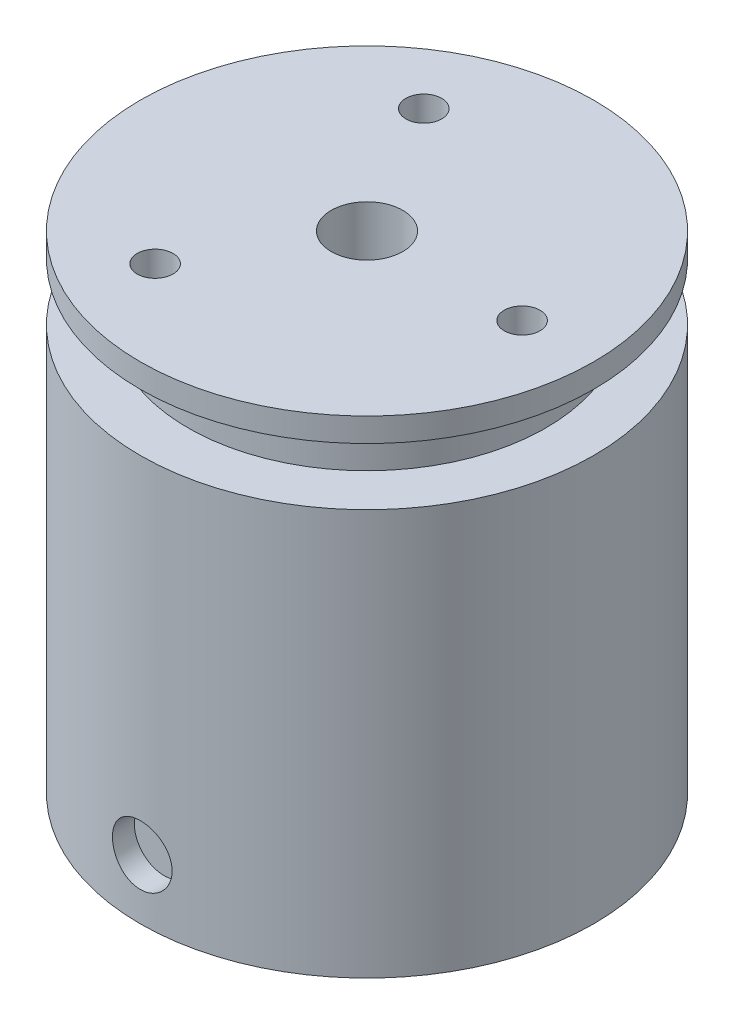
ISO-10303-21;
HEADER;
FILE_DESCRIPTION(('STEP AP214'),'2;1');
FILE_NAME('part.step','',(''),(''),'','','');
FILE_SCHEMA(('AUTOMOTIVE_DESIGN { 1 0 10303 214 1 1 1 1 }'));
ENDSEC;
DATA;
#1=APPLICATION_CONTEXT('core data for automotive mechanical design processes');
#2=APPLICATION_PROTOCOL_DEFINITION('international standard','automotive_design',2000,#1);
#3=PRODUCT_CONTEXT('',#1,'mechanical');
#4=PRODUCT('Part','Part','',(#3));
#5=PRODUCT_RELATED_PRODUCT_CATEGORY('part','',(#4));
#6=PRODUCT_DEFINITION_FORMATION('','',#4);
#7=PRODUCT_DEFINITION_CONTEXT('part definition',#1,'design');
#8=PRODUCT_DEFINITION('design','',#6,#7);
#9=PRODUCT_DEFINITION_SHAPE('','',#8);
#10=(LENGTH_UNIT() NAMED_UNIT(*) SI_UNIT(.MILLI.,.METRE.));
#11=(NAMED_UNIT(*) PLANE_ANGLE_UNIT() SI_UNIT($,.RADIAN.));
#12=(NAMED_UNIT(*) SI_UNIT($,.STERADIAN.) SOLID_ANGLE_UNIT());
#13=UNCERTAINTY_MEASURE_WITH_UNIT(LENGTH_MEASURE(1.E-05),#10,'distance_accuracy_value','');
#14=(GEOMETRIC_REPRESENTATION_CONTEXT(3) GLOBAL_UNCERTAINTY_ASSIGNED_CONTEXT((#13)) GLOBAL_UNIT_ASSIGNED_CONTEXT((#10,
#11,#12)) REPRESENTATION_CONTEXT('',''));
#15=CARTESIAN_POINT('',(0.,0.,0.));
#16=DIRECTION('',(0.,0.,1.));
#17=DIRECTION('',(1.,0.,0.));
#18=AXIS2_PLACEMENT_3D('',#15,#16,#17);
#19=CARTESIAN_POINT('',(-2.53,2.47,17.));
#20=DIRECTION('',(0.,0.,1.));
#21=DIRECTION('',(1.,0.,0.));
#22=AXIS2_PLACEMENT_3D('',#19,#20,#21);
#23=PLANE('',#22);
#24=CARTESIAN_POINT('',(0.,5.,17.));
#25=DIRECTION('',(0.,0.,-1.));
#26=DIRECTION('',(-1.,0.,0.));
#27=AXIS2_PLACEMENT_3D('',#24,#25,#26);
#28=CIRCLE('',#27,2.5);
#29=CARTESIAN_POINT('',(-2.5,5.,17.));
#30=VERTEX_POINT('',#29);
#31=EDGE_CURVE('E19',#30,#30,#28,.T.);
#32=ORIENTED_EDGE('',*,*,#31,.F.);
#33=EDGE_LOOP('',(#32));
#34=FACE_BOUND('',#33,.T.);
#35=ADVANCED_FACE('F15',(#34),#23,.T.);
#36=CARTESIAN_POINT('',(-19.228,0.,-19.228));
#37=DIRECTION('',(0.,1.,0.));
#38=DIRECTION('',(0.,0.,1.));
#39=AXIS2_PLACEMENT_3D('',#36,#37,#38);
#40=PLANE('',#39);
#41=CARTESIAN_POINT('',(0.,0.,0.));
#42=DIRECTION('',(0.,-1.,0.));
#43=DIRECTION('',(0.,0.,-1.));
#44=AXIS2_PLACEMENT_3D('',#41,#42,#43);
#45=CIRCLE('',#44,19.);
#46=CARTESIAN_POINT('',(0.,0.,-19.));
#47=VERTEX_POINT('',#46);
#48=EDGE_CURVE('E69',#47,#47,#45,.T.);
#49=ORIENTED_EDGE('',*,*,#48,.T.);
#50=EDGE_LOOP('',(#49));
#51=FACE_BOUND('',#50,.T.);
#52=ADVANCED_FACE('F77',(#51),#40,.F.);
#53=CARTESIAN_POINT('',(0.,5.,19.012));
#54=DIRECTION('',(0.,0.,-1.));
#55=DIRECTION('',(-1.,0.,0.));
#56=AXIS2_PLACEMENT_3D('',#53,#54,#55);
#57=CYLINDRICAL_SURFACE('',#56,2.5);
#58=CARTESIAN_POINT('',(-7.79392660219532E-09,2.5,19.));
#59=CARTESIAN_POINT('',(0.139773409392555,2.5000060204504,18.9999979277637));
#60=CARTESIAN_POINT('',(0.279636082187468,2.51176185948341,18.9984413236045));
#61=CARTESIAN_POINT('',(0.555469342091036,2.55847151360698,18.9923812398033));
#62=CARTESIAN_POINT('',(0.691435609073626,2.59345011200258,18.9878746119713));
#63=CARTESIAN_POINT('',(0.955439265130195,2.68555389483406,18.9764218144305));
#64=CARTESIAN_POINT('',(1.08348208052161,2.74266372376853,18.96947733651));
#65=CARTESIAN_POINT('',(1.32813772879356,2.87737167655391,18.9539203209782));
#66=CARTESIAN_POINT('',(1.44475290274007,2.95496559195393,18.9453081260958));
#67=CARTESIAN_POINT('',(1.66397097375114,3.12893476538717,18.9273183528514));
#68=CARTESIAN_POINT('',(1.76649577885706,3.22540803378587,18.9179369355255));
#69=CARTESIAN_POINT('',(1.95397273230088,3.43421563147291,18.8994944166227));
#70=CARTESIAN_POINT('',(2.03892009793698,3.54655426366593,18.89043340278));
#71=CARTESIAN_POINT('',(2.18913182772488,3.78444268043728,18.8736179843208));
#72=CARTESIAN_POINT('',(2.2543124912531,3.91004568956786,18.8658691956794));
#73=CARTESIAN_POINT('',(2.36255778994847,4.17044685287685,18.8526210808482));
#74=CARTESIAN_POINT('',(2.40564711126428,4.30523455181653,18.847119245188));
#75=CARTESIAN_POINT('',(2.45796752429332,4.53396111521166,18.8403506985919));
#76=CARTESIAN_POINT('',(2.47370721362991,4.62643997145124,18.83828246754));
#77=CARTESIAN_POINT('',(2.49472542952821,4.81259918285274,18.8355105071207));
#78=CARTESIAN_POINT('',(2.50000404101751,4.90627952825423,18.8348067666758));
#79=CARTESIAN_POINT('',(2.49999397301701,5.13976752832974,18.8348103416708));
#80=CARTESIAN_POINT('',(2.48823909231892,5.27962431484546,18.836380823103));
#81=CARTESIAN_POINT('',(2.44153359351058,5.55544534192569,18.8424904606705));
#82=CARTESIAN_POINT('',(2.40655817198268,5.69140525780772,18.8470327911615));
#83=CARTESIAN_POINT('',(2.31446368165708,5.9553954819417,18.8585629828817));
#84=CARTESIAN_POINT('',(2.25736011852096,6.08343127010354,18.8655491313426));
#85=CARTESIAN_POINT('',(2.12266692582656,6.32807512422551,18.8811773903824));
#86=CARTESIAN_POINT('',(2.04508148960602,6.44468552265953,18.8898191618996));
#87=CARTESIAN_POINT('',(1.87112091274146,6.66390890511079,18.9078442412996));
#88=CARTESIAN_POINT('',(1.77464586474557,6.76644230299737,18.9172313269442));
#89=CARTESIAN_POINT('',(1.56583109022531,6.95393586507857,18.9356577794715));
#90=CARTESIAN_POINT('',(1.45348708346821,7.03889127278613,18.9446970517011));
#91=CARTESIAN_POINT('',(1.215593895158,7.18911146078125,18.9614502977649));
#92=CARTESIAN_POINT('',(1.08999241463198,7.25429400461762,18.9691586806554));
#93=CARTESIAN_POINT('',(0.829594558290329,7.36254321649766,18.9823259545178));
#94=CARTESIAN_POINT('',(0.694808625035482,7.40563454177621,18.9877873521238));
#95=CARTESIAN_POINT('',(0.466076711301946,7.45796066430534,18.9945035751173));
#96=CARTESIAN_POINT('',(0.373590272854385,7.47370293843485,18.9965548575456));
#97=CARTESIAN_POINT('',(0.187415925748185,7.49472458394411,18.9993037594859));
#98=CARTESIAN_POINT('',(0.0937280265576765,7.50000403772535,19.000001389659));
#99=CARTESIAN_POINT('',(-0.139773424995147,7.49999397867805,18.999997927649));
#100=CARTESIAN_POINT('',(-0.279636097731497,7.4882381387704,18.9984413233747));
#101=CARTESIAN_POINT('',(-0.55546935737123,7.44152848291757,18.9923812393555));
#102=CARTESIAN_POINT('',(-0.691435624148335,7.40654988366705,18.9878746114205));
#103=CARTESIAN_POINT('',(-0.955439279651721,7.31444609917194,18.9764218136975));
#104=CARTESIAN_POINT('',(-1.08348209469562,7.25733626942894,18.9694773356977));
#105=CARTESIAN_POINT('',(-1.32813774214314,7.12262831509405,18.9539203200402));
#106=CARTESIAN_POINT('',(-1.44475291561275,7.04503439895298,18.9453081251112));
#107=CARTESIAN_POINT('',(-1.66397098555335,6.87106522411821,18.9273183518106));
#108=CARTESIAN_POINT('',(-1.76649579006465,6.77459195505899,18.9179369344753));
#109=CARTESIAN_POINT('',(-1.95397274221704,6.56578435615487,18.8994944155947));
#110=CARTESIAN_POINT('',(-2.03892010715629,6.45344572340532,18.8904334017836));
#111=CARTESIAN_POINT('',(-2.18913183544506,6.21555730565706,18.8736179834207));
#112=CARTESIAN_POINT('',(-2.25431249817324,6.08995429610826,18.8658691948438));
#113=CARTESIAN_POINT('',(-2.3625577952265,5.82955313210752,18.8526210801907));
#114=CARTESIAN_POINT('',(-2.40564711570206,5.69476543289491,18.8471192446436));
#115=CARTESIAN_POINT('',(-2.45796752593738,5.46603887486305,18.8403506983597));
#116=CARTESIAN_POINT('',(-2.47370721399312,5.37356002435567,18.8382824674427));
#117=CARTESIAN_POINT('',(-2.4947254288001,5.18740082457235,18.8355105072661));
#118=CARTESIAN_POINT('',(-2.50000404047948,5.0937204850569,18.8348067669289));
#119=CARTESIAN_POINT('',(-2.49999397433957,4.86023249084673,18.8348103417495));
#120=CARTESIAN_POINT('',(-2.48823909453172,4.72037570424856,18.8363808228775));
#121=CARTESIAN_POINT('',(-2.44153359770267,4.44455467679156,18.8424904600579));
#122=CARTESIAN_POINT('',(-2.40655817725921,4.30859476061585,18.8470327904671));
#123=CARTESIAN_POINT('',(-2.31446368898315,4.04460453576372,18.8585629819981));
#124=CARTESIAN_POINT('',(-2.25736012681819,3.91656874717541,18.8655491303512));
#125=CARTESIAN_POINT('',(-2.12266693600496,3.67192489205288,18.88117738923));
#126=CARTESIAN_POINT('',(-2.04508150069615,3.55531449304387,18.8898191606937));
#127=CARTESIAN_POINT('',(-1.87112092555102,3.3360911092946,18.9078442400292));
#128=CARTESIAN_POINT('',(-1.77464587836211,3.2335577106843,18.917231325663));
#129=CARTESIAN_POINT('',(-1.56583110532721,3.04606414702566,18.9356577782183));
#130=CARTESIAN_POINT('',(-1.45348709924801,2.96110873846486,18.9446970504866));
#131=CARTESIAN_POINT('',(-1.21559391212397,2.81088854863972,18.9614502966737));
#132=CARTESIAN_POINT('',(-1.08999243210311,2.74570600383006,18.9691586796487));
#133=CARTESIAN_POINT('',(-0.829594576600506,2.6374567899318,18.9823259537147));
#134=CARTESIAN_POINT('',(-0.694808643679673,2.59436546360852,18.9877873514399));
#135=CARTESIAN_POINT('',(-0.466076729735803,2.54203933916609,18.9945035746671));
#136=CARTESIAN_POINT('',(-0.373590290780151,2.5262970642485,18.9965548571957));
#137=CARTESIAN_POINT('',(-0.18741594256709,2.50527541729572,18.9993037593228));
#138=CARTESIAN_POINT('',(-0.0937280427778114,2.49999596285905,19.0000013895821));
#139=CARTESIAN_POINT('',(-7.79392660219532E-09,2.5,19.));
#140=B_SPLINE_CURVE_WITH_KNOTS('',3,(#58,#59,#60,#61,#62,#63,#64,#65,#66,#67,#68,#69,#70,#71,
#72,#73,#74,#75,#76,#77,#78,#79,#80,#81,#82,#83,#84,#85,#86,#87,#88,#89,#90,#91,#92,#93,#94,#95,
#96,#97,#98,#99,#100,#101,#102,#103,#104,#105,#106,#107,#108,#109,#110,#111,#112,#113,#114,#115,
#116,#117,#118,#119,#120,#121,#122,#123,#124,#125,#126,#127,#128,#129,#130,#131,#132,#133,#134,
#135,#136,#137,#138,#139),.UNSPECIFIED.,.T.,.F.,(4,2,2,2,2,2,2,2,2,2,2,2,2,2,2,2,2,2,2,2,2,2,2,
2,2,2,2,2,2,2,2,2,2,2,2,2,2,2,2,2,4),(0.,0.418977449349682,0.838402751289426,1.25753755932456,
1.67658632313426,2.09787118820846,2.51927053173498,2.94243011449595,3.36511579782529,
3.64604964814875,3.92698121771937,4.34594093444101,4.7653488917125,5.18446349075289,
5.60349234920208,6.02480043024977,6.44622236579401,6.86937371832254,7.29205173419249,
7.57300817666715,7.85396240641896,8.27293985581508,8.69236515780693,9.11149996588963,
9.53054872974783,9.95183359488269,10.3732329384697,10.7963925212364,11.2190782045378,
11.500012037383,11.7809435894603,12.1999033061593,12.619311263495,13.0384258624869,
13.4574547208532,13.8787628018204,14.3001847372962,14.7233360898384,15.1460141057243,
15.4269705500924,15.707924781738),.UNSPECIFIED.);
#141=CARTESIAN_POINT('',(-7.79392660219532E-09,2.5,19.));
#142=VERTEX_POINT('',#141);
#143=EDGE_CURVE('E63',#142,#142,#140,.T.);
#144=ORIENTED_EDGE('',*,*,#143,.T.);
#145=EDGE_LOOP('',(#144));
#146=FACE_BOUND('',#145,.T.);
#147=ORIENTED_EDGE('',*,*,#31,.T.);
#148=EDGE_LOOP('',(#147));
#149=FACE_BOUND('',#148,.T.);
#150=ADVANCED_FACE('F73',(#146,#149),#57,.F.);
#151=CARTESIAN_POINT('',(0.,34.,0.));
#152=DIRECTION('',(0.,-1.,0.));
#153=DIRECTION('',(0.,0.,-1.));
#154=AXIS2_PLACEMENT_3D('',#151,#152,#153);
#155=CYLINDRICAL_SURFACE('',#154,19.);
#156=ORIENTED_EDGE('',*,*,#48,.F.);
#157=EDGE_LOOP('',(#156));
#158=FACE_BOUND('',#157,.T.);
#159=ORIENTED_EDGE('',*,*,#143,.F.);
#160=EDGE_LOOP('',(#159));
#161=FACE_BOUND('',#160,.T.);
#162=CARTESIAN_POINT('',(0.,34.,0.));
#163=DIRECTION('',(0.,-1.,0.));
#164=DIRECTION('',(0.,0.,-1.));
#165=AXIS2_PLACEMENT_3D('',#162,#163,#164);
#166=CIRCLE('',#165,19.);
#167=CARTESIAN_POINT('',(0.,34.,-19.));
#168=VERTEX_POINT('',#167);
#169=EDGE_CURVE('E60',#168,#168,#166,.F.);
#170=ORIENTED_EDGE('',*,*,#169,.F.);
#171=EDGE_LOOP('',(#170));
#172=FACE_BOUND('',#171,.T.);
#173=ADVANCED_FACE('F70',(#158,#161,#172),#155,.T.);
#174=CARTESIAN_POINT('',(-19.228,34.,-19.228));
#175=DIRECTION('',(0.,1.,0.));
#176=DIRECTION('',(0.,0.,1.));
#177=AXIS2_PLACEMENT_3D('',#174,#175,#176);
#178=PLANE('',#177);
#179=CARTESIAN_POINT('',(0.,34.,0.));
#180=DIRECTION('',(0.,-1.,0.));
#181=DIRECTION('',(0.,0.,-1.));
#182=AXIS2_PLACEMENT_3D('',#179,#180,#181);
#183=CIRCLE('',#182,15.);
#184=CARTESIAN_POINT('',(0.,34.,-15.));
#185=VERTEX_POINT('',#184);
#186=EDGE_CURVE('E57',#185,#185,#183,.T.);
#187=ORIENTED_EDGE('',*,*,#186,.T.);
#188=EDGE_LOOP('',(#187));
#189=FACE_BOUND('',#188,.T.);
#190=ORIENTED_EDGE('',*,*,#169,.T.);
#191=EDGE_LOOP('',(#190));
#192=FACE_BOUND('',#191,.T.);
#193=ADVANCED_FACE('F85',(#189,#192),#178,.T.);
#194=CARTESIAN_POINT('',(0.,38.8,0.));
#195=DIRECTION('',(0.,-1.,0.));
#196=DIRECTION('',(0.,0.,-1.));
#197=AXIS2_PLACEMENT_3D('',#194,#195,#196);
#198=CYLINDRICAL_SURFACE('',#197,15.);
#199=CARTESIAN_POINT('',(0.,38.8,0.));
#200=DIRECTION('',(0.,-1.,0.));
#201=DIRECTION('',(0.,0.,-1.));
#202=AXIS2_PLACEMENT_3D('',#199,#200,#201);
#203=CIRCLE('',#202,15.);
#204=CARTESIAN_POINT('',(0.,38.8,-15.));
#205=VERTEX_POINT('',#204);
#206=EDGE_CURVE('E54',#205,#205,#203,.T.);
#207=ORIENTED_EDGE('',*,*,#206,.T.);
#208=EDGE_LOOP('',(#207));
#209=FACE_BOUND('',#208,.T.);
#210=ORIENTED_EDGE('',*,*,#186,.F.);
#211=EDGE_LOOP('',(#210));
#212=FACE_BOUND('',#211,.T.);
#213=ADVANCED_FACE('F88',(#209,#212),#198,.T.);
#214=CARTESIAN_POINT('',(-19.228,38.8,-19.228));
#215=DIRECTION('',(0.,1.,0.));
#216=DIRECTION('',(0.,0.,1.));
#217=AXIS2_PLACEMENT_3D('',#214,#215,#216);
#218=PLANE('',#217);
#219=ORIENTED_EDGE('',*,*,#206,.F.);
#220=EDGE_LOOP('',(#219));
#221=FACE_BOUND('',#220,.T.);
#222=CARTESIAN_POINT('',(0.,38.8,0.));
#223=DIRECTION('',(0.,-1.,0.));
#224=DIRECTION('',(1.,0.,0.));
#225=AXIS2_PLACEMENT_3D('',#222,#223,#224);
#226=CIRCLE('',#225,19.);
#227=CARTESIAN_POINT('',(19.,38.8,0.));
#228=VERTEX_POINT('',#227);
#229=EDGE_CURVE('E51',#228,#228,#226,.T.);
#230=ORIENTED_EDGE('',*,*,#229,.T.);
#231=EDGE_LOOP('',(#230));
#232=FACE_BOUND('',#231,.T.);
#233=ADVANCED_FACE('F90',(#221,#232),#218,.F.);
#234=CARTESIAN_POINT('',(11.482,33.8,-1.518));
#235=DIRECTION('',(0.,1.,0.));
#236=DIRECTION('',(0.,0.,1.));
#237=AXIS2_PLACEMENT_3D('',#234,#235,#236);
#238=PLANE('',#237);
#239=CARTESIAN_POINT('',(13.,33.8,0.));
#240=DIRECTION('',(0.,1.,0.));
#241=DIRECTION('',(0.,0.,1.));
#242=AXIS2_PLACEMENT_3D('',#239,#240,#241);
#243=CIRCLE('',#242,1.5);
#244=CARTESIAN_POINT('',(13.,33.8,1.5));
#245=VERTEX_POINT('',#244);
#246=EDGE_CURVE('E48',#245,#245,#243,.F.);
#247=ORIENTED_EDGE('',*,*,#246,.F.);
#248=EDGE_LOOP('',(#247));
#249=FACE_BOUND('',#248,.T.);
#250=ADVANCED_FACE('F93',(#249),#238,.T.);
#251=CARTESIAN_POINT('',(-8.018,33.8,9.740330249));
#252=DIRECTION('',(0.,1.,0.));
#253=DIRECTION('',(0.,0.,1.));
#254=AXIS2_PLACEMENT_3D('',#251,#252,#253);
#255=PLANE('',#254);
#256=CARTESIAN_POINT('',(-6.5,33.8,11.258330249));
#257=DIRECTION('',(0.,1.,0.));
#258=DIRECTION('',(0.,0.,1.));
#259=AXIS2_PLACEMENT_3D('',#256,#257,#258);
#260=CIRCLE('',#259,1.5);
#261=CARTESIAN_POINT('',(-6.5,33.8,12.758330249));
#262=VERTEX_POINT('',#261);
#263=EDGE_CURVE('E45',#262,#262,#260,.F.);
#264=ORIENTED_EDGE('',*,*,#263,.F.);
#265=EDGE_LOOP('',(#264));
#266=FACE_BOUND('',#265,.T.);
#267=ADVANCED_FACE('F97',(#266),#255,.T.);
#268=CARTESIAN_POINT('',(-8.018,33.8,-12.776330249));
#269=DIRECTION('',(0.,1.,0.));
#270=DIRECTION('',(0.,0.,1.));
#271=AXIS2_PLACEMENT_3D('',#268,#269,#270);
#272=PLANE('',#271);
#273=CARTESIAN_POINT('',(-6.5,33.8,-11.258330249));
#274=DIRECTION('',(0.,1.,0.));
#275=DIRECTION('',(0.,0.,1.));
#276=AXIS2_PLACEMENT_3D('',#273,#274,#275);
#277=CIRCLE('',#276,1.5);
#278=CARTESIAN_POINT('',(-6.5,33.8,-9.758330249));
#279=VERTEX_POINT('',#278);
#280=EDGE_CURVE('E42',#279,#279,#277,.F.);
#281=ORIENTED_EDGE('',*,*,#280,.F.);
#282=EDGE_LOOP('',(#281));
#283=FACE_BOUND('',#282,.T.);
#284=ADVANCED_FACE('F101',(#283),#272,.T.);
#285=CARTESIAN_POINT('',(0.,40.8,0.));
#286=DIRECTION('',(0.,-1.,0.));
#287=DIRECTION('',(1.,0.,0.));
#288=AXIS2_PLACEMENT_3D('',#285,#286,#287);
#289=CYLINDRICAL_SURFACE('',#288,19.);
#290=ORIENTED_EDGE('',*,*,#229,.F.);
#291=EDGE_LOOP('',(#290));
#292=FACE_BOUND('',#291,.T.);
#293=CARTESIAN_POINT('',(0.,40.8,0.));
#294=DIRECTION('',(0.,-1.,0.));
#295=DIRECTION('',(1.,0.,0.));
#296=AXIS2_PLACEMENT_3D('',#293,#294,#295);
#297=CIRCLE('',#296,19.);
#298=CARTESIAN_POINT('',(19.,40.8,0.));
#299=VERTEX_POINT('',#298);
#300=EDGE_CURVE('E39',#299,#299,#297,.F.);
#301=ORIENTED_EDGE('',*,*,#300,.F.);
#302=EDGE_LOOP('',(#301));
#303=FACE_BOUND('',#302,.T.);
#304=ADVANCED_FACE('F104',(#292,#303),#289,.T.);
#305=CARTESIAN_POINT('',(13.,33.8,0.));
#306=DIRECTION('',(0.,1.,0.));
#307=DIRECTION('',(0.,0.,1.));
#308=AXIS2_PLACEMENT_3D('',#305,#306,#307);
#309=CYLINDRICAL_SURFACE('',#308,1.5);
#310=CARTESIAN_POINT('',(13.,40.8,0.));
#311=DIRECTION('',(0.,1.,0.));
#312=DIRECTION('',(0.,0.,1.));
#313=AXIS2_PLACEMENT_3D('',#310,#311,#312);
#314=CIRCLE('',#313,1.5);
#315=CARTESIAN_POINT('',(13.,40.8,1.5));
#316=VERTEX_POINT('',#315);
#317=EDGE_CURVE('E36',#316,#316,#314,.F.);
#318=ORIENTED_EDGE('',*,*,#317,.F.);
#319=EDGE_LOOP('',(#318));
#320=FACE_BOUND('',#319,.T.);
#321=ORIENTED_EDGE('',*,*,#246,.T.);
#322=EDGE_LOOP('',(#321));
#323=FACE_BOUND('',#322,.T.);
#324=ADVANCED_FACE('F129',(#320,#323),#309,.F.);
#325=CARTESIAN_POINT('',(-6.5,33.8,11.258330249));
#326=DIRECTION('',(0.,1.,0.));
#327=DIRECTION('',(0.,0.,1.));
#328=AXIS2_PLACEMENT_3D('',#325,#326,#327);
#329=CYLINDRICAL_SURFACE('',#328,1.5);
#330=CARTESIAN_POINT('',(-6.5,40.8,11.258330249));
#331=DIRECTION('',(0.,1.,0.));
#332=DIRECTION('',(0.,0.,1.));
#333=AXIS2_PLACEMENT_3D('',#330,#331,#332);
#334=CIRCLE('',#333,1.5);
#335=CARTESIAN_POINT('',(-6.5,40.8,12.758330249));
#336=VERTEX_POINT('',#335);
#337=EDGE_CURVE('E33',#336,#336,#334,.F.);
#338=ORIENTED_EDGE('',*,*,#337,.F.);
#339=EDGE_LOOP('',(#338));
#340=FACE_BOUND('',#339,.T.);
#341=ORIENTED_EDGE('',*,*,#263,.T.);
#342=EDGE_LOOP('',(#341));
#343=FACE_BOUND('',#342,.T.);
#344=ADVANCED_FACE('F117',(#340,#343),#329,.F.);
#345=CARTESIAN_POINT('',(-6.5,33.8,-11.258330249));
#346=DIRECTION('',(0.,1.,0.));
#347=DIRECTION('',(0.,0.,1.));
#348=AXIS2_PLACEMENT_3D('',#345,#346,#347);
#349=CYLINDRICAL_SURFACE('',#348,1.5);
#350=CARTESIAN_POINT('',(-6.5,40.8,-11.258330249));
#351=DIRECTION('',(0.,1.,0.));
#352=DIRECTION('',(0.,0.,1.));
#353=AXIS2_PLACEMENT_3D('',#350,#351,#352);
#354=CIRCLE('',#353,1.5);
#355=CARTESIAN_POINT('',(-6.5,40.8,-9.758330249));
#356=VERTEX_POINT('',#355);
#357=EDGE_CURVE('E28',#356,#356,#354,.F.);
#358=ORIENTED_EDGE('',*,*,#357,.F.);
#359=EDGE_LOOP('',(#358));
#360=FACE_BOUND('',#359,.T.);
#361=ORIENTED_EDGE('',*,*,#280,.T.);
#362=EDGE_LOOP('',(#361));
#363=FACE_BOUND('',#362,.T.);
#364=ADVANCED_FACE('F108',(#360,#363),#349,.F.);
#365=CARTESIAN_POINT('',(-3.036,35.8,-3.036));
#366=DIRECTION('',(0.,1.,0.));
#367=DIRECTION('',(0.,0.,1.));
#368=AXIS2_PLACEMENT_3D('',#365,#366,#367);
#369=PLANE('',#368);
#370=CARTESIAN_POINT('',(0.,35.8,0.));
#371=DIRECTION('',(0.,1.,0.));
#372=DIRECTION('',(0.,0.,1.));
#373=AXIS2_PLACEMENT_3D('',#370,#371,#372);
#374=CIRCLE('',#373,3.);
#375=CARTESIAN_POINT('',(0.,35.8,3.));
#376=VERTEX_POINT('',#375);
#377=EDGE_CURVE('E23',#376,#376,#374,.F.);
#378=ORIENTED_EDGE('',*,*,#377,.F.);
#379=EDGE_LOOP('',(#378));
#380=FACE_BOUND('',#379,.T.);
#381=ADVANCED_FACE('F106',(#380),#369,.T.);
#382=CARTESIAN_POINT('',(-19.228,40.8,-19.228));
#383=DIRECTION('',(0.,1.,0.));
#384=DIRECTION('',(0.,0.,1.));
#385=AXIS2_PLACEMENT_3D('',#382,#383,#384);
#386=PLANE('',#385);
#387=ORIENTED_EDGE('',*,*,#357,.T.);
#388=EDGE_LOOP('',(#387));
#389=FACE_BOUND('',#388,.T.);
#390=ORIENTED_EDGE('',*,*,#337,.T.);
#391=EDGE_LOOP('',(#390));
#392=FACE_BOUND('',#391,.T.);
#393=ORIENTED_EDGE('',*,*,#317,.T.);
#394=EDGE_LOOP('',(#393));
#395=FACE_BOUND('',#394,.T.);
#396=CARTESIAN_POINT('',(0.,40.8,0.));
#397=DIRECTION('',(0.,1.,0.));
#398=DIRECTION('',(0.,0.,1.));
#399=AXIS2_PLACEMENT_3D('',#396,#397,#398);
#400=CIRCLE('',#399,3.);
#401=CARTESIAN_POINT('',(0.,40.8,3.));
#402=VERTEX_POINT('',#401);
#403=EDGE_CURVE('E10',#402,#402,#400,.T.);
#404=ORIENTED_EDGE('',*,*,#403,.F.);
#405=EDGE_LOOP('',(#404));
#406=FACE_BOUND('',#405,.T.);
#407=ORIENTED_EDGE('',*,*,#300,.T.);
#408=EDGE_LOOP('',(#407));
#409=FACE_BOUND('',#408,.T.);
#410=ADVANCED_FACE('F17',(#389,#392,#395,#406,#409),#386,.T.);
#411=CARTESIAN_POINT('',(0.,35.8,0.));
#412=DIRECTION('',(0.,1.,0.));
#413=DIRECTION('',(0.,0.,1.));
#414=AXIS2_PLACEMENT_3D('',#411,#412,#413);
#415=CYLINDRICAL_SURFACE('',#414,3.);
#416=ORIENTED_EDGE('',*,*,#403,.T.);
#417=EDGE_LOOP('',(#416));
#418=FACE_BOUND('',#417,.T.);
#419=ORIENTED_EDGE('',*,*,#377,.T.);
#420=EDGE_LOOP('',(#419));
#421=FACE_BOUND('',#420,.T.);
#422=ADVANCED_FACE('F115',(#418,#421),#415,.F.);
#423=CLOSED_SHELL('',(#35,#52,#150,#173,#193,#213,#233,#250,#267,#284,#304,#324,#344,#364,#381,
#410,#422));
#424=MANIFOLD_SOLID_BREP('B1',#423);
#425=ADVANCED_BREP_SHAPE_REPRESENTATION('',(#18,#424),#14);
#426=SHAPE_DEFINITION_REPRESENTATION(#9,#425);
ENDSEC;
END-ISO-10303-21;
